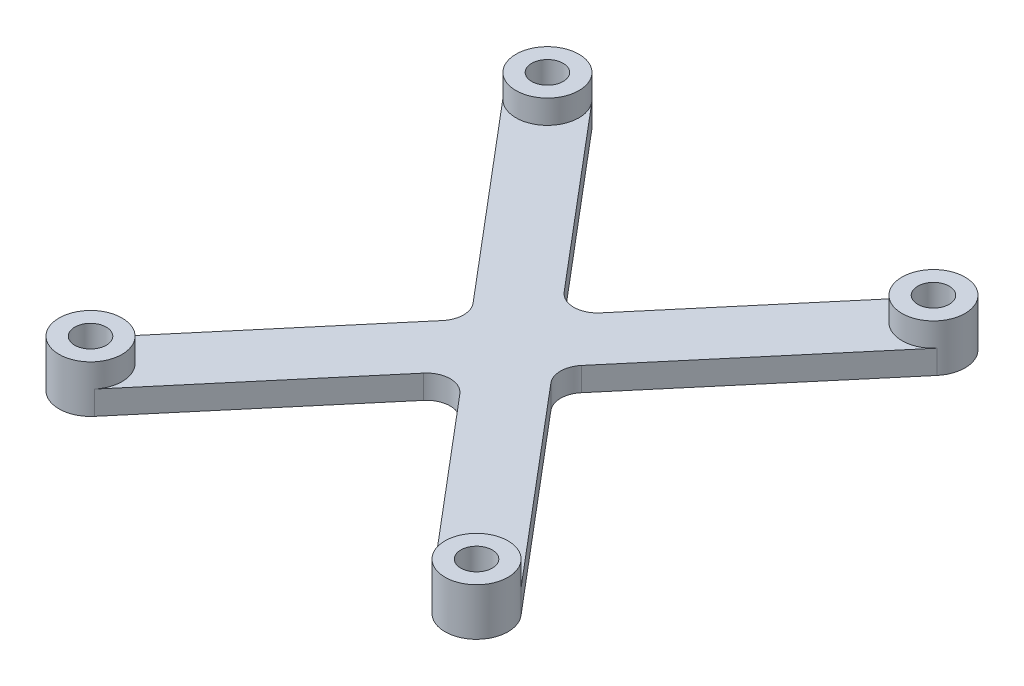
ISO-10303-21;
HEADER;
FILE_DESCRIPTION(('STEP AP214'),'2;1');
FILE_NAME('part.step','',(''),(''),'','','');
FILE_SCHEMA(('AUTOMOTIVE_DESIGN { 1 0 10303 214 1 1 1 1 }'));
ENDSEC;
DATA;
#1=APPLICATION_CONTEXT('core data for automotive mechanical design processes');
#2=APPLICATION_PROTOCOL_DEFINITION('international standard','automotive_design',2000,#1);
#3=PRODUCT_CONTEXT('',#1,'mechanical');
#4=PRODUCT('Part','Part','',(#3));
#5=PRODUCT_RELATED_PRODUCT_CATEGORY('part','',(#4));
#6=PRODUCT_DEFINITION_FORMATION('','',#4);
#7=PRODUCT_DEFINITION_CONTEXT('part definition',#1,'design');
#8=PRODUCT_DEFINITION('design','',#6,#7);
#9=PRODUCT_DEFINITION_SHAPE('','',#8);
#10=(LENGTH_UNIT() NAMED_UNIT(*) SI_UNIT(.MILLI.,.METRE.));
#11=(NAMED_UNIT(*) PLANE_ANGLE_UNIT() SI_UNIT($,.RADIAN.));
#12=(NAMED_UNIT(*) SI_UNIT($,.STERADIAN.) SOLID_ANGLE_UNIT());
#13=UNCERTAINTY_MEASURE_WITH_UNIT(LENGTH_MEASURE(1.E-05),#10,'distance_accuracy_value','');
#14=(GEOMETRIC_REPRESENTATION_CONTEXT(3) GLOBAL_UNCERTAINTY_ASSIGNED_CONTEXT((#13)) GLOBAL_UNIT_ASSIGNED_CONTEXT((#10,
#11,#12)) REPRESENTATION_CONTEXT('',''));
#15=CARTESIAN_POINT('',(0.,0.,0.));
#16=DIRECTION('',(0.,0.,1.));
#17=DIRECTION('',(1.,0.,0.));
#18=AXIS2_PLACEMENT_3D('',#15,#16,#17);
#19=CARTESIAN_POINT('',(0.,3.,0.));
#20=DIRECTION('',(0.,1.,0.));
#21=DIRECTION('',(0.,0.,1.));
#22=AXIS2_PLACEMENT_3D('',#19,#20,#21);
#23=PLANE('',#22);
#24=DIRECTION('',(0.64535164916821,0.,0.763885625546045));
#25=VECTOR('',#24,1.);
#26=CARTESIAN_POINT('',(-3.05554250218419,3.,2.58140659667285));
#27=LINE('',#26,#25);
#28=CARTESIAN_POINT('',(2.29165687663813,3.,8.9107446369115));
#29=VERTEX_POINT('',#28);
#30=CARTESIAN_POINT('',(21.4444574978158,3.,31.5814065966729));
#31=VERTEX_POINT('',#30);
#32=EDGE_CURVE('E168',#29,#31,#27,.T.);
#33=ORIENTED_EDGE('',*,*,#32,.T.);
#34=CARTESIAN_POINT('',(24.5,3.,29.));
#35=DIRECTION('',(0.,1.,0.));
#36=DIRECTION('',(0.,0.,1.));
#37=AXIS2_PLACEMENT_3D('',#34,#35,#36);
#38=CIRCLE('',#37,4.00000000000001);
#39=CARTESIAN_POINT('',(27.5555425021842,3.,26.4185934033272));
#40=VERTEX_POINT('',#39);
#41=EDGE_CURVE('E157',#40,#31,#38,.T.);
#42=ORIENTED_EDGE('',*,*,#41,.F.);
#43=DIRECTION('',(0.64535164916821,0.,0.763885625546045));
#44=VECTOR('',#43,1.);
#45=CARTESIAN_POINT('',(3.05554250218418,3.,-2.58140659667284));
#46=LINE('',#45,#44);
#47=CARTESIAN_POINT('',(6.8720186343341,3.,1.93605494750463));
#48=VERTEX_POINT('',#47);
#49=EDGE_CURVE('E163',#48,#40,#46,.T.);
#50=ORIENTED_EDGE('',*,*,#49,.F.);
#51=CARTESIAN_POINT('',(9.16367551097223,3.,0.));
#52=DIRECTION('',(0.,1.,0.));
#53=DIRECTION('',(0.,0.,1.));
#54=AXIS2_PLACEMENT_3D('',#51,#52,#53);
#55=CIRCLE('',#54,3.);
#56=CARTESIAN_POINT('',(6.8720186343341,3.,-1.93605494750463));
#57=VERTEX_POINT('',#56);
#58=EDGE_CURVE('E196',#48,#57,#55,.F.);
#59=ORIENTED_EDGE('',*,*,#58,.T.);
#60=DIRECTION('',(0.64535164916821,0.,-0.763885625546045));
#61=VECTOR('',#60,1.);
#62=CARTESIAN_POINT('',(3.05554250218418,3.,2.58140659667284));
#63=LINE('',#62,#61);
#64=CARTESIAN_POINT('',(27.5555425021842,3.,-26.4185934033272));
#65=VERTEX_POINT('',#64);
#66=EDGE_CURVE('E167',#57,#65,#63,.T.);
#67=ORIENTED_EDGE('',*,*,#66,.T.);
#68=CARTESIAN_POINT('',(24.5,3.,-29.));
#69=DIRECTION('',(0.,1.,0.));
#70=DIRECTION('',(0.,0.,1.));
#71=AXIS2_PLACEMENT_3D('',#68,#69,#70);
#72=CIRCLE('',#71,4.);
#73=CARTESIAN_POINT('',(21.4444574978158,3.,-31.5814065966729));
#74=VERTEX_POINT('',#73);
#75=EDGE_CURVE('E11',#65,#74,#72,.F.);
#76=ORIENTED_EDGE('',*,*,#75,.T.);
#77=DIRECTION('',(0.64535164916821,0.,-0.763885625546045));
#78=VECTOR('',#77,1.);
#79=CARTESIAN_POINT('',(-3.05554250218418,3.,-2.58140659667284));
#80=LINE('',#79,#78);
#81=CARTESIAN_POINT('',(2.29165687663813,3.,-8.9107446369115));
#82=VERTEX_POINT('',#81);
#83=EDGE_CURVE('E213',#82,#74,#80,.T.);
#84=ORIENTED_EDGE('',*,*,#83,.F.);
#85=CARTESIAN_POINT('',(0.,3.,-10.8467995844161));
#86=DIRECTION('',(0.,1.,0.));
#87=DIRECTION('',(0.,0.,1.));
#88=AXIS2_PLACEMENT_3D('',#85,#86,#87);
#89=CIRCLE('',#88,3.);
#90=CARTESIAN_POINT('',(-2.29165687663814,3.,-8.9107446369115));
#91=VERTEX_POINT('',#90);
#92=EDGE_CURVE('E279',#82,#91,#89,.F.);
#93=ORIENTED_EDGE('',*,*,#92,.T.);
#94=DIRECTION('',(0.64535164916821,0.,0.763885625546045));
#95=VECTOR('',#94,1.);
#96=CARTESIAN_POINT('',(3.05554250218418,3.,-2.58140659667284));
#97=LINE('',#96,#95);
#98=CARTESIAN_POINT('',(-21.4444574978158,3.,-31.5814065966728));
#99=VERTEX_POINT('',#98);
#100=EDGE_CURVE('E197',#99,#91,#97,.T.);
#101=ORIENTED_EDGE('',*,*,#100,.F.);
#102=CARTESIAN_POINT('',(-24.5,3.,-29.));
#103=DIRECTION('',(0.,1.,0.));
#104=DIRECTION('',(0.,0.,1.));
#105=AXIS2_PLACEMENT_3D('',#102,#103,#104);
#106=CIRCLE('',#105,4.);
#107=CARTESIAN_POINT('',(-27.5555425021842,3.,-26.4185934033272));
#108=VERTEX_POINT('',#107);
#109=EDGE_CURVE('E46',#108,#99,#106,.T.);
#110=ORIENTED_EDGE('',*,*,#109,.F.);
#111=DIRECTION('',(0.64535164916821,0.,0.763885625546045));
#112=VECTOR('',#111,1.);
#113=CARTESIAN_POINT('',(-3.05554250218419,3.,2.58140659667285));
#114=LINE('',#113,#112);
#115=CARTESIAN_POINT('',(-6.87201863433412,3.,-1.93605494750463));
#116=VERTEX_POINT('',#115);
#117=EDGE_CURVE('E200',#108,#116,#114,.T.);
#118=ORIENTED_EDGE('',*,*,#117,.T.);
#119=CARTESIAN_POINT('',(-9.16367551097225,3.,0.));
#120=DIRECTION('',(0.,1.,0.));
#121=DIRECTION('',(0.,0.,1.));
#122=AXIS2_PLACEMENT_3D('',#119,#120,#121);
#123=CIRCLE('',#122,3.);
#124=CARTESIAN_POINT('',(-6.87201863433412,3.,1.93605494750463));
#125=VERTEX_POINT('',#124);
#126=EDGE_CURVE('E283',#116,#125,#123,.F.);
#127=ORIENTED_EDGE('',*,*,#126,.T.);
#128=DIRECTION('',(0.64535164916821,0.,-0.763885625546045));
#129=VECTOR('',#128,1.);
#130=CARTESIAN_POINT('',(-3.05554250218418,3.,-2.58140659667284));
#131=LINE('',#130,#129);
#132=CARTESIAN_POINT('',(-27.5555425021842,3.,26.4185934033272));
#133=VERTEX_POINT('',#132);
#134=EDGE_CURVE('E204',#133,#125,#131,.T.);
#135=ORIENTED_EDGE('',*,*,#134,.F.);
#136=CARTESIAN_POINT('',(-24.5,3.,29.));
#137=DIRECTION('',(0.,1.,0.));
#138=DIRECTION('',(0.,0.,1.));
#139=AXIS2_PLACEMENT_3D('',#136,#137,#138);
#140=CIRCLE('',#139,4.);
#141=CARTESIAN_POINT('',(-21.4444574978158,3.,31.5814065966728));
#142=VERTEX_POINT('',#141);
#143=EDGE_CURVE('E176',#142,#133,#140,.T.);
#144=ORIENTED_EDGE('',*,*,#143,.F.);
#145=DIRECTION('',(0.64535164916821,0.,-0.763885625546045));
#146=VECTOR('',#145,1.);
#147=CARTESIAN_POINT('',(3.05554250218418,3.,2.58140659667284));
#148=LINE('',#147,#146);
#149=CARTESIAN_POINT('',(-2.29165687663814,3.,8.9107446369115));
#150=VERTEX_POINT('',#149);
#151=EDGE_CURVE('E207',#142,#150,#148,.T.);
#152=ORIENTED_EDGE('',*,*,#151,.T.);
#153=CARTESIAN_POINT('',(0.,3.,10.8467995844161));
#154=DIRECTION('',(0.,1.,0.));
#155=DIRECTION('',(0.,0.,1.));
#156=AXIS2_PLACEMENT_3D('',#153,#154,#155);
#157=CIRCLE('',#156,3.);
#158=EDGE_CURVE('E287',#150,#29,#157,.F.);
#159=ORIENTED_EDGE('',*,*,#158,.T.);
#160=EDGE_LOOP('',(#33,#42,#50,#59,#67,#76,#84,#93,#101,#110,#118,#127,#135,#144,#152,#159));
#161=FACE_BOUND('',#160,.T.);
#162=ADVANCED_FACE('F38',(#161),#23,.T.);
#163=CARTESIAN_POINT('',(3.05554250218418,3.,-2.58140659667284));
#164=DIRECTION('',(0.763885625546045,0.,-0.64535164916821));
#165=DIRECTION('',(-0.64535164916821,0.,-0.763885625546045));
#166=AXIS2_PLACEMENT_3D('',#163,#164,#165);
#167=PLANE('',#166);
#168=ORIENTED_EDGE('',*,*,#100,.T.);
#169=DIRECTION('',(0.,-1.,0.));
#170=VECTOR('',#169,1.);
#171=CARTESIAN_POINT('',(-2.29165687663814,0.,-8.9107446369115));
#172=LINE('',#171,#170);
#173=CARTESIAN_POINT('',(-2.29165687663814,0.,-8.9107446369115));
#174=VERTEX_POINT('',#173);
#175=EDGE_CURVE('E258',#91,#174,#172,.T.);
#176=ORIENTED_EDGE('',*,*,#175,.T.);
#177=DIRECTION('',(0.64535164916821,0.,0.763885625546045));
#178=VECTOR('',#177,1.);
#179=CARTESIAN_POINT('',(3.05554250218418,0.,-2.58140659667284));
#180=LINE('',#179,#178);
#181=CARTESIAN_POINT('',(-21.4444574978158,0.,-31.5814065966728));
#182=VERTEX_POINT('',#181);
#183=EDGE_CURVE('E193',#182,#174,#180,.T.);
#184=ORIENTED_EDGE('',*,*,#183,.F.);
#185=DIRECTION('',(0.,-1.,0.));
#186=VECTOR('',#185,1.);
#187=CARTESIAN_POINT('',(-21.4444574978158,3.,-31.5814065966728));
#188=LINE('',#187,#186);
#189=EDGE_CURVE('E256',#99,#182,#188,.T.);
#190=ORIENTED_EDGE('',*,*,#189,.F.);
#191=EDGE_LOOP('',(#168,#176,#184,#190));
#192=FACE_BOUND('',#191,.T.);
#193=ADVANCED_FACE('F308',(#192),#167,.T.);
#194=CARTESIAN_POINT('',(-24.5,3.,-29.));
#195=DIRECTION('',(0.,-1.,0.));
#196=DIRECTION('',(0.,0.,-1.));
#197=AXIS2_PLACEMENT_3D('',#194,#195,#196);
#198=CYLINDRICAL_SURFACE('',#197,4.);
#199=CARTESIAN_POINT('',(-24.5,0.,-29.));
#200=DIRECTION('',(0.,1.,0.));
#201=DIRECTION('',(0.,0.,1.));
#202=AXIS2_PLACEMENT_3D('',#199,#200,#201);
#203=CIRCLE('',#202,4.);
#204=CARTESIAN_POINT('',(-27.5555425021842,0.,-26.4185934033272));
#205=VERTEX_POINT('',#204);
#206=EDGE_CURVE('E219',#182,#205,#203,.T.);
#207=ORIENTED_EDGE('',*,*,#206,.T.);
#208=DIRECTION('',(0.,-1.,0.));
#209=VECTOR('',#208,1.);
#210=CARTESIAN_POINT('',(-27.5555425021842,3.,-26.4185934033272));
#211=LINE('',#210,#209);
#212=EDGE_CURVE('E253',#108,#205,#211,.T.);
#213=ORIENTED_EDGE('',*,*,#212,.F.);
#214=ORIENTED_EDGE('',*,*,#109,.T.);
#215=ORIENTED_EDGE('',*,*,#189,.T.);
#216=EDGE_LOOP('',(#207,#213,#214,#215));
#217=FACE_BOUND('',#216,.T.);
#218=CARTESIAN_POINT('',(-24.5,6.,-29.));
#219=DIRECTION('',(0.,1.,0.));
#220=DIRECTION('',(0.,0.,1.));
#221=AXIS2_PLACEMENT_3D('',#218,#219,#220);
#222=CIRCLE('',#221,4.);
#223=CARTESIAN_POINT('',(-24.5,6.,-25.));
#224=VERTEX_POINT('',#223);
#225=EDGE_CURVE('E190',#224,#224,#222,.T.);
#226=ORIENTED_EDGE('',*,*,#225,.F.);
#227=EDGE_LOOP('',(#226));
#228=FACE_BOUND('',#227,.T.);
#229=ADVANCED_FACE('F313',(#217,#228),#198,.T.);
#230=CARTESIAN_POINT('',(-3.05554250218419,3.,2.58140659667285));
#231=DIRECTION('',(0.763885625546045,0.,-0.64535164916821));
#232=DIRECTION('',(-0.64535164916821,0.,-0.763885625546045));
#233=AXIS2_PLACEMENT_3D('',#230,#231,#232);
#234=PLANE('',#233);
#235=DIRECTION('',(0.64535164916821,0.,0.763885625546045));
#236=VECTOR('',#235,1.);
#237=CARTESIAN_POINT('',(-3.05554250218419,0.,2.58140659667285));
#238=LINE('',#237,#236);
#239=CARTESIAN_POINT('',(-6.87201863433412,0.,-1.93605494750463));
#240=VERTEX_POINT('',#239);
#241=EDGE_CURVE('E221',#205,#240,#238,.T.);
#242=ORIENTED_EDGE('',*,*,#241,.T.);
#243=DIRECTION('',(0.,-1.,0.));
#244=VECTOR('',#243,1.);
#245=CARTESIAN_POINT('',(-6.87201863433412,3.,-1.93605494750463));
#246=LINE('',#245,#244);
#247=EDGE_CURVE('E266',#240,#116,#246,.F.);
#248=ORIENTED_EDGE('',*,*,#247,.T.);
#249=ORIENTED_EDGE('',*,*,#117,.F.);
#250=ORIENTED_EDGE('',*,*,#212,.T.);
#251=EDGE_LOOP('',(#242,#248,#249,#250));
#252=FACE_BOUND('',#251,.T.);
#253=ADVANCED_FACE('F352',(#252),#234,.F.);
#254=CARTESIAN_POINT('',(-3.05554250218418,3.,-2.58140659667284));
#255=DIRECTION('',(-0.763885625546044,0.,-0.64535164916821));
#256=DIRECTION('',(-0.64535164916821,0.,0.763885625546045));
#257=AXIS2_PLACEMENT_3D('',#254,#255,#256);
#258=PLANE('',#257);
#259=ORIENTED_EDGE('',*,*,#134,.T.);
#260=DIRECTION('',(0.,-1.,0.));
#261=VECTOR('',#260,1.);
#262=CARTESIAN_POINT('',(-6.87201863433412,3.,1.93605494750463));
#263=LINE('',#262,#261);
#264=CARTESIAN_POINT('',(-6.87201863433412,0.,1.93605494750463));
#265=VERTEX_POINT('',#264);
#266=EDGE_CURVE('E263',#125,#265,#263,.T.);
#267=ORIENTED_EDGE('',*,*,#266,.T.);
#268=DIRECTION('',(0.64535164916821,0.,-0.763885625546045));
#269=VECTOR('',#268,1.);
#270=CARTESIAN_POINT('',(-3.05554250218418,0.,-2.58140659667284));
#271=LINE('',#270,#269);
#272=CARTESIAN_POINT('',(-27.5555425021842,0.,26.4185934033272));
#273=VERTEX_POINT('',#272);
#274=EDGE_CURVE('E224',#273,#265,#271,.T.);
#275=ORIENTED_EDGE('',*,*,#274,.F.);
#276=DIRECTION('',(0.,-1.,0.));
#277=VECTOR('',#276,1.);
#278=CARTESIAN_POINT('',(-27.5555425021842,3.,26.4185934033272));
#279=LINE('',#278,#277);
#280=EDGE_CURVE('E251',#133,#273,#279,.T.);
#281=ORIENTED_EDGE('',*,*,#280,.F.);
#282=EDGE_LOOP('',(#259,#267,#275,#281));
#283=FACE_BOUND('',#282,.T.);
#284=ADVANCED_FACE('F348',(#283),#258,.T.);
#285=CARTESIAN_POINT('',(-24.5,3.,29.));
#286=DIRECTION('',(0.,-1.,0.));
#287=DIRECTION('',(0.,0.,-1.));
#288=AXIS2_PLACEMENT_3D('',#285,#286,#287);
#289=CYLINDRICAL_SURFACE('',#288,4.);
#290=CARTESIAN_POINT('',(-24.5,0.,29.));
#291=DIRECTION('',(0.,1.,0.));
#292=DIRECTION('',(0.,0.,1.));
#293=AXIS2_PLACEMENT_3D('',#290,#291,#292);
#294=CIRCLE('',#293,4.);
#295=CARTESIAN_POINT('',(-21.4444574978158,0.,31.5814065966728));
#296=VERTEX_POINT('',#295);
#297=EDGE_CURVE('E227',#273,#296,#294,.T.);
#298=ORIENTED_EDGE('',*,*,#297,.T.);
#299=DIRECTION('',(0.,-1.,0.));
#300=VECTOR('',#299,1.);
#301=CARTESIAN_POINT('',(-21.4444574978158,3.,31.5814065966728));
#302=LINE('',#301,#300);
#303=EDGE_CURVE('E248',#142,#296,#302,.T.);
#304=ORIENTED_EDGE('',*,*,#303,.F.);
#305=ORIENTED_EDGE('',*,*,#143,.T.);
#306=ORIENTED_EDGE('',*,*,#280,.T.);
#307=EDGE_LOOP('',(#298,#304,#305,#306));
#308=FACE_BOUND('',#307,.T.);
#309=CARTESIAN_POINT('',(-24.5,6.,29.));
#310=DIRECTION('',(0.,1.,0.));
#311=DIRECTION('',(0.,0.,1.));
#312=AXIS2_PLACEMENT_3D('',#309,#310,#311);
#313=CIRCLE('',#312,4.);
#314=CARTESIAN_POINT('',(-24.5,6.,33.));
#315=VERTEX_POINT('',#314);
#316=EDGE_CURVE('E172',#315,#315,#313,.T.);
#317=ORIENTED_EDGE('',*,*,#316,.F.);
#318=EDGE_LOOP('',(#317));
#319=FACE_BOUND('',#318,.T.);
#320=ADVANCED_FACE('F344',(#308,#319),#289,.T.);
#321=CARTESIAN_POINT('',(3.05554250218418,3.,2.58140659667284));
#322=DIRECTION('',(-0.763885625546044,0.,-0.64535164916821));
#323=DIRECTION('',(-0.64535164916821,0.,0.763885625546045));
#324=AXIS2_PLACEMENT_3D('',#321,#322,#323);
#325=PLANE('',#324);
#326=DIRECTION('',(0.64535164916821,0.,-0.763885625546045));
#327=VECTOR('',#326,1.);
#328=CARTESIAN_POINT('',(3.05554250218418,0.,2.58140659667284));
#329=LINE('',#328,#327);
#330=CARTESIAN_POINT('',(-2.29165687663814,0.,8.9107446369115));
#331=VERTEX_POINT('',#330);
#332=EDGE_CURVE('E229',#296,#331,#329,.T.);
#333=ORIENTED_EDGE('',*,*,#332,.T.);
#334=DIRECTION('',(0.,-1.,0.));
#335=VECTOR('',#334,1.);
#336=CARTESIAN_POINT('',(-2.29165687663814,3.,8.9107446369115));
#337=LINE('',#336,#335);
#338=EDGE_CURVE('E271',#331,#150,#337,.F.);
#339=ORIENTED_EDGE('',*,*,#338,.T.);
#340=ORIENTED_EDGE('',*,*,#151,.F.);
#341=ORIENTED_EDGE('',*,*,#303,.T.);
#342=EDGE_LOOP('',(#333,#339,#340,#341));
#343=FACE_BOUND('',#342,.T.);
#344=ADVANCED_FACE('F340',(#343),#325,.F.);
#345=CARTESIAN_POINT('',(-3.05554250218419,3.,2.58140659667285));
#346=DIRECTION('',(0.763885625546045,0.,-0.64535164916821));
#347=DIRECTION('',(-0.64535164916821,0.,-0.763885625546045));
#348=AXIS2_PLACEMENT_3D('',#345,#346,#347);
#349=PLANE('',#348);
#350=ORIENTED_EDGE('',*,*,#32,.F.);
#351=DIRECTION('',(0.,-1.,0.));
#352=VECTOR('',#351,1.);
#353=CARTESIAN_POINT('',(2.29165687663812,0.,8.9107446369115));
#354=LINE('',#353,#352);
#355=CARTESIAN_POINT('',(2.29165687663813,0.,8.9107446369115));
#356=VERTEX_POINT('',#355);
#357=EDGE_CURVE('E268',#29,#356,#354,.T.);
#358=ORIENTED_EDGE('',*,*,#357,.T.);
#359=DIRECTION('',(0.64535164916821,0.,0.763885625546045));
#360=VECTOR('',#359,1.);
#361=CARTESIAN_POINT('',(-3.05554250218419,0.,2.58140659667285));
#362=LINE('',#361,#360);
#363=CARTESIAN_POINT('',(21.4444574978158,0.,31.5814065966729));
#364=VERTEX_POINT('',#363);
#365=EDGE_CURVE('E232',#356,#364,#362,.T.);
#366=ORIENTED_EDGE('',*,*,#365,.T.);
#367=DIRECTION('',(0.,-1.,0.));
#368=VECTOR('',#367,1.);
#369=CARTESIAN_POINT('',(21.4444574978158,3.,31.5814065966729));
#370=LINE('',#369,#368);
#371=EDGE_CURVE('E160',#31,#364,#370,.T.);
#372=ORIENTED_EDGE('',*,*,#371,.F.);
#373=EDGE_LOOP('',(#350,#358,#366,#372));
#374=FACE_BOUND('',#373,.T.);
#375=ADVANCED_FACE('F337',(#374),#349,.F.);
#376=CARTESIAN_POINT('',(24.5,3.,29.));
#377=DIRECTION('',(0.,-1.,0.));
#378=DIRECTION('',(0.,0.,-1.));
#379=AXIS2_PLACEMENT_3D('',#376,#377,#378);
#380=CYLINDRICAL_SURFACE('',#379,4.00000000000001);
#381=CARTESIAN_POINT('',(24.5,0.,29.));
#382=DIRECTION('',(0.,1.,0.));
#383=DIRECTION('',(0.,0.,1.));
#384=AXIS2_PLACEMENT_3D('',#381,#382,#383);
#385=CIRCLE('',#384,4.00000000000001);
#386=CARTESIAN_POINT('',(27.5555425021842,0.,26.4185934033272));
#387=VERTEX_POINT('',#386);
#388=EDGE_CURVE('E159',#364,#387,#385,.T.);
#389=ORIENTED_EDGE('',*,*,#388,.T.);
#390=DIRECTION('',(0.,-1.,0.));
#391=VECTOR('',#390,1.);
#392=CARTESIAN_POINT('',(27.5555425021842,3.,26.4185934033272));
#393=LINE('',#392,#391);
#394=EDGE_CURVE('E152',#40,#387,#393,.T.);
#395=ORIENTED_EDGE('',*,*,#394,.F.);
#396=ORIENTED_EDGE('',*,*,#41,.T.);
#397=ORIENTED_EDGE('',*,*,#371,.T.);
#398=EDGE_LOOP('',(#389,#395,#396,#397));
#399=FACE_BOUND('',#398,.T.);
#400=CARTESIAN_POINT('',(24.5,6.,29.));
#401=DIRECTION('',(0.,1.,0.));
#402=DIRECTION('',(0.,0.,1.));
#403=AXIS2_PLACEMENT_3D('',#400,#401,#402);
#404=CIRCLE('',#403,4.00000000000001);
#405=CARTESIAN_POINT('',(24.5,6.,33.));
#406=VERTEX_POINT('',#405);
#407=EDGE_CURVE('E173',#406,#406,#404,.T.);
#408=ORIENTED_EDGE('',*,*,#407,.F.);
#409=EDGE_LOOP('',(#408));
#410=FACE_BOUND('',#409,.T.);
#411=ADVANCED_FACE('F153',(#399,#410),#380,.T.);
#412=CARTESIAN_POINT('',(3.05554250218418,3.,-2.58140659667284));
#413=DIRECTION('',(0.763885625546045,0.,-0.64535164916821));
#414=DIRECTION('',(-0.64535164916821,0.,-0.763885625546045));
#415=AXIS2_PLACEMENT_3D('',#412,#413,#414);
#416=PLANE('',#415);
#417=DIRECTION('',(0.64535164916821,0.,0.763885625546045));
#418=VECTOR('',#417,1.);
#419=CARTESIAN_POINT('',(3.05554250218418,0.,-2.58140659667284));
#420=LINE('',#419,#418);
#421=CARTESIAN_POINT('',(6.8720186343341,0.,1.93605494750463));
#422=VERTEX_POINT('',#421);
#423=EDGE_CURVE('E235',#422,#387,#420,.T.);
#424=ORIENTED_EDGE('',*,*,#423,.F.);
#425=DIRECTION('',(0.,-1.,0.));
#426=VECTOR('',#425,1.);
#427=CARTESIAN_POINT('',(6.8720186343341,3.,1.93605494750463));
#428=LINE('',#427,#426);
#429=EDGE_CURVE('E53',#422,#48,#428,.F.);
#430=ORIENTED_EDGE('',*,*,#429,.T.);
#431=ORIENTED_EDGE('',*,*,#49,.T.);
#432=ORIENTED_EDGE('',*,*,#394,.T.);
#433=EDGE_LOOP('',(#424,#430,#431,#432));
#434=FACE_BOUND('',#433,.T.);
#435=ADVANCED_FACE('F164',(#434),#416,.T.);
#436=CARTESIAN_POINT('',(3.05554250218418,3.,2.58140659667284));
#437=DIRECTION('',(-0.763885625546044,0.,-0.64535164916821));
#438=DIRECTION('',(-0.64535164916821,0.,0.763885625546045));
#439=AXIS2_PLACEMENT_3D('',#436,#437,#438);
#440=PLANE('',#439);
#441=ORIENTED_EDGE('',*,*,#66,.F.);
#442=DIRECTION('',(0.,-1.,0.));
#443=VECTOR('',#442,1.);
#444=CARTESIAN_POINT('',(6.8720186343341,3.,-1.93605494750463));
#445=LINE('',#444,#443);
#446=CARTESIAN_POINT('',(6.8720186343341,0.,-1.93605494750463));
#447=VERTEX_POINT('',#446);
#448=EDGE_CURVE('E273',#57,#447,#445,.T.);
#449=ORIENTED_EDGE('',*,*,#448,.T.);
#450=DIRECTION('',(0.64535164916821,0.,-0.763885625546045));
#451=VECTOR('',#450,1.);
#452=CARTESIAN_POINT('',(3.05554250218418,0.,2.58140659667284));
#453=LINE('',#452,#451);
#454=CARTESIAN_POINT('',(27.5555425021842,0.,-26.4185934033272));
#455=VERTEX_POINT('',#454);
#456=EDGE_CURVE('E237',#447,#455,#453,.T.);
#457=ORIENTED_EDGE('',*,*,#456,.T.);
#458=DIRECTION('',(0.,-1.,0.));
#459=VECTOR('',#458,1.);
#460=CARTESIAN_POINT('',(27.5555425021842,3.,-26.4185934033272));
#461=LINE('',#460,#459);
#462=EDGE_CURVE('E161',#65,#455,#461,.T.);
#463=ORIENTED_EDGE('',*,*,#462,.F.);
#464=EDGE_LOOP('',(#441,#449,#457,#463));
#465=FACE_BOUND('',#464,.T.);
#466=ADVANCED_FACE('F294',(#465),#440,.F.);
#467=CARTESIAN_POINT('',(24.5,3.,-29.));
#468=DIRECTION('',(0.,-1.,0.));
#469=DIRECTION('',(0.,0.,-1.));
#470=AXIS2_PLACEMENT_3D('',#467,#468,#469);
#471=CYLINDRICAL_SURFACE('',#470,4.);
#472=CARTESIAN_POINT('',(24.5,0.,-29.));
#473=DIRECTION('',(0.,1.,0.));
#474=DIRECTION('',(0.,0.,1.));
#475=AXIS2_PLACEMENT_3D('',#472,#473,#474);
#476=CIRCLE('',#475,4.);
#477=CARTESIAN_POINT('',(21.4444574978158,0.,-31.5814065966729));
#478=VERTEX_POINT('',#477);
#479=EDGE_CURVE('E239',#455,#478,#476,.T.);
#480=ORIENTED_EDGE('',*,*,#479,.T.);
#481=DIRECTION('',(0.,-1.,0.));
#482=VECTOR('',#481,1.);
#483=CARTESIAN_POINT('',(21.4444574978158,3.,-31.5814065966729));
#484=LINE('',#483,#482);
#485=EDGE_CURVE('E216',#74,#478,#484,.T.);
#486=ORIENTED_EDGE('',*,*,#485,.F.);
#487=ORIENTED_EDGE('',*,*,#75,.F.);
#488=ORIENTED_EDGE('',*,*,#462,.T.);
#489=EDGE_LOOP('',(#480,#486,#487,#488));
#490=FACE_BOUND('',#489,.T.);
#491=CARTESIAN_POINT('',(24.5,6.,-29.));
#492=DIRECTION('',(0.,1.,0.));
#493=DIRECTION('',(0.,0.,1.));
#494=AXIS2_PLACEMENT_3D('',#491,#492,#493);
#495=CIRCLE('',#494,4.);
#496=CARTESIAN_POINT('',(24.5,6.,-25.));
#497=VERTEX_POINT('',#496);
#498=EDGE_CURVE('E186',#497,#497,#495,.T.);
#499=ORIENTED_EDGE('',*,*,#498,.F.);
#500=EDGE_LOOP('',(#499));
#501=FACE_BOUND('',#500,.T.);
#502=ADVANCED_FACE('F326',(#490,#501),#471,.T.);
#503=CARTESIAN_POINT('',(-3.05554250218418,3.,-2.58140659667284));
#504=DIRECTION('',(-0.763885625546044,0.,-0.64535164916821));
#505=DIRECTION('',(-0.64535164916821,0.,0.763885625546045));
#506=AXIS2_PLACEMENT_3D('',#503,#504,#505);
#507=PLANE('',#506);
#508=DIRECTION('',(0.64535164916821,0.,-0.763885625546045));
#509=VECTOR('',#508,1.);
#510=CARTESIAN_POINT('',(-3.05554250218418,0.,-2.58140659667284));
#511=LINE('',#510,#509);
#512=CARTESIAN_POINT('',(2.29165687663813,0.,-8.9107446369115));
#513=VERTEX_POINT('',#512);
#514=EDGE_CURVE('E201',#513,#478,#511,.T.);
#515=ORIENTED_EDGE('',*,*,#514,.F.);
#516=DIRECTION('',(0.,-1.,0.));
#517=VECTOR('',#516,1.);
#518=CARTESIAN_POINT('',(2.29165687663813,3.,-8.9107446369115));
#519=LINE('',#518,#517);
#520=EDGE_CURVE('E261',#513,#82,#519,.F.);
#521=ORIENTED_EDGE('',*,*,#520,.T.);
#522=ORIENTED_EDGE('',*,*,#83,.T.);
#523=ORIENTED_EDGE('',*,*,#485,.T.);
#524=EDGE_LOOP('',(#515,#521,#522,#523));
#525=FACE_BOUND('',#524,.T.);
#526=ADVANCED_FACE('F322',(#525),#507,.T.);
#527=CARTESIAN_POINT('',(0.,0.,0.));
#528=DIRECTION('',(0.,1.,0.));
#529=DIRECTION('',(0.,0.,1.));
#530=AXIS2_PLACEMENT_3D('',#527,#528,#529);
#531=PLANE('',#530);
#532=CARTESIAN_POINT('',(24.5,0.,29.));
#533=DIRECTION('',(0.,1.,0.));
#534=DIRECTION('',(0.,0.,1.));
#535=AXIS2_PLACEMENT_3D('',#532,#533,#534);
#536=CIRCLE('',#535,2.);
#537=CARTESIAN_POINT('',(24.5,0.,31.));
#538=VERTEX_POINT('',#537);
#539=EDGE_CURVE('E449',#538,#538,#536,.T.);
#540=ORIENTED_EDGE('',*,*,#539,.T.);
#541=EDGE_LOOP('',(#540));
#542=FACE_BOUND('',#541,.T.);
#543=CARTESIAN_POINT('',(24.5,0.,-29.));
#544=DIRECTION('',(0.,1.,0.));
#545=DIRECTION('',(0.,0.,1.));
#546=AXIS2_PLACEMENT_3D('',#543,#544,#545);
#547=CIRCLE('',#546,2.);
#548=CARTESIAN_POINT('',(24.5,0.,-27.));
#549=VERTEX_POINT('',#548);
#550=EDGE_CURVE('E443',#549,#549,#547,.T.);
#551=ORIENTED_EDGE('',*,*,#550,.T.);
#552=EDGE_LOOP('',(#551));
#553=FACE_BOUND('',#552,.T.);
#554=CARTESIAN_POINT('',(-24.5,0.,-29.));
#555=DIRECTION('',(0.,1.,0.));
#556=DIRECTION('',(0.,0.,1.));
#557=AXIS2_PLACEMENT_3D('',#554,#555,#556);
#558=CIRCLE('',#557,2.);
#559=CARTESIAN_POINT('',(-24.5,0.,-27.));
#560=VERTEX_POINT('',#559);
#561=EDGE_CURVE('E432',#560,#560,#558,.T.);
#562=ORIENTED_EDGE('',*,*,#561,.T.);
#563=EDGE_LOOP('',(#562));
#564=FACE_BOUND('',#563,.T.);
#565=CARTESIAN_POINT('',(-24.5,0.,29.));
#566=DIRECTION('',(0.,1.,0.));
#567=DIRECTION('',(0.,0.,1.));
#568=AXIS2_PLACEMENT_3D('',#565,#566,#567);
#569=CIRCLE('',#568,2.);
#570=CARTESIAN_POINT('',(-24.5,0.,31.));
#571=VERTEX_POINT('',#570);
#572=EDGE_CURVE('E179',#571,#571,#569,.T.);
#573=ORIENTED_EDGE('',*,*,#572,.T.);
#574=EDGE_LOOP('',(#573));
#575=FACE_BOUND('',#574,.T.);
#576=ORIENTED_EDGE('',*,*,#183,.T.);
#577=CARTESIAN_POINT('',(0.,0.,-10.8467995844161));
#578=DIRECTION('',(0.,1.,0.));
#579=DIRECTION('',(0.,0.,1.));
#580=AXIS2_PLACEMENT_3D('',#577,#578,#579);
#581=CIRCLE('',#580,3.);
#582=EDGE_CURVE('E277',#174,#513,#581,.T.);
#583=ORIENTED_EDGE('',*,*,#582,.T.);
#584=ORIENTED_EDGE('',*,*,#514,.T.);
#585=ORIENTED_EDGE('',*,*,#479,.F.);
#586=ORIENTED_EDGE('',*,*,#456,.F.);
#587=CARTESIAN_POINT('',(9.16367551097223,0.,0.));
#588=DIRECTION('',(0.,1.,0.));
#589=DIRECTION('',(0.,0.,1.));
#590=AXIS2_PLACEMENT_3D('',#587,#588,#589);
#591=CIRCLE('',#590,3.);
#592=EDGE_CURVE('E61',#447,#422,#591,.T.);
#593=ORIENTED_EDGE('',*,*,#592,.T.);
#594=ORIENTED_EDGE('',*,*,#423,.T.);
#595=ORIENTED_EDGE('',*,*,#388,.F.);
#596=ORIENTED_EDGE('',*,*,#365,.F.);
#597=CARTESIAN_POINT('',(0.,0.,10.8467995844161));
#598=DIRECTION('',(0.,1.,0.));
#599=DIRECTION('',(0.,0.,1.));
#600=AXIS2_PLACEMENT_3D('',#597,#598,#599);
#601=CIRCLE('',#600,3.);
#602=EDGE_CURVE('E285',#356,#331,#601,.T.);
#603=ORIENTED_EDGE('',*,*,#602,.T.);
#604=ORIENTED_EDGE('',*,*,#332,.F.);
#605=ORIENTED_EDGE('',*,*,#297,.F.);
#606=ORIENTED_EDGE('',*,*,#274,.T.);
#607=CARTESIAN_POINT('',(-9.16367551097225,0.,0.));
#608=DIRECTION('',(0.,1.,0.));
#609=DIRECTION('',(0.,0.,1.));
#610=AXIS2_PLACEMENT_3D('',#607,#608,#609);
#611=CIRCLE('',#610,3.);
#612=EDGE_CURVE('E281',#265,#240,#611,.T.);
#613=ORIENTED_EDGE('',*,*,#612,.T.);
#614=ORIENTED_EDGE('',*,*,#241,.F.);
#615=ORIENTED_EDGE('',*,*,#206,.F.);
#616=EDGE_LOOP('',(#576,#583,#584,#585,#586,#593,#594,#595,#596,#603,#604,#605,#606,#613,#614,#615));
#617=FACE_BOUND('',#616,.T.);
#618=ADVANCED_FACE('F318',(#542,#553,#564,#575,#617),#531,.F.);
#619=CARTESIAN_POINT('',(0.,3.,-10.8467995844161));
#620=DIRECTION('',(0.,1.,0.));
#621=DIRECTION('',(0.,0.,1.));
#622=AXIS2_PLACEMENT_3D('',#619,#620,#621);
#623=CYLINDRICAL_SURFACE('',#622,3.);
#624=ORIENTED_EDGE('',*,*,#92,.F.);
#625=ORIENTED_EDGE('',*,*,#520,.F.);
#626=ORIENTED_EDGE('',*,*,#582,.F.);
#627=ORIENTED_EDGE('',*,*,#175,.F.);
#628=EDGE_LOOP('',(#624,#625,#626,#627));
#629=FACE_BOUND('',#628,.T.);
#630=ADVANCED_FACE('F321',(#629),#623,.F.);
#631=CARTESIAN_POINT('',(-9.16367551097225,3.,0.));
#632=DIRECTION('',(0.,-1.,0.));
#633=DIRECTION('',(0.,0.,-1.));
#634=AXIS2_PLACEMENT_3D('',#631,#632,#633);
#635=CYLINDRICAL_SURFACE('',#634,3.);
#636=ORIENTED_EDGE('',*,*,#126,.F.);
#637=ORIENTED_EDGE('',*,*,#247,.F.);
#638=ORIENTED_EDGE('',*,*,#612,.F.);
#639=ORIENTED_EDGE('',*,*,#266,.F.);
#640=EDGE_LOOP('',(#636,#637,#638,#639));
#641=FACE_BOUND('',#640,.T.);
#642=ADVANCED_FACE('F305',(#641),#635,.F.);
#643=CARTESIAN_POINT('',(0.,3.,10.8467995844161));
#644=DIRECTION('',(0.,1.,0.));
#645=DIRECTION('',(0.,0.,1.));
#646=AXIS2_PLACEMENT_3D('',#643,#644,#645);
#647=CYLINDRICAL_SURFACE('',#646,3.);
#648=ORIENTED_EDGE('',*,*,#158,.F.);
#649=ORIENTED_EDGE('',*,*,#338,.F.);
#650=ORIENTED_EDGE('',*,*,#602,.F.);
#651=ORIENTED_EDGE('',*,*,#357,.F.);
#652=EDGE_LOOP('',(#648,#649,#650,#651));
#653=FACE_BOUND('',#652,.T.);
#654=ADVANCED_FACE('F297',(#653),#647,.F.);
#655=CARTESIAN_POINT('',(9.16367551097223,3.,0.));
#656=DIRECTION('',(0.,-1.,0.));
#657=DIRECTION('',(0.,0.,-1.));
#658=AXIS2_PLACEMENT_3D('',#655,#656,#657);
#659=CYLINDRICAL_SURFACE('',#658,3.);
#660=ORIENTED_EDGE('',*,*,#58,.F.);
#661=ORIENTED_EDGE('',*,*,#429,.F.);
#662=ORIENTED_EDGE('',*,*,#592,.F.);
#663=ORIENTED_EDGE('',*,*,#448,.F.);
#664=EDGE_LOOP('',(#660,#661,#662,#663));
#665=FACE_BOUND('',#664,.T.);
#666=ADVANCED_FACE('F40',(#665),#659,.F.);
#667=CARTESIAN_POINT('',(-24.5,6.,-29.));
#668=DIRECTION('',(0.,1.,0.));
#669=DIRECTION('',(0.,0.,1.));
#670=AXIS2_PLACEMENT_3D('',#667,#668,#669);
#671=PLANE('',#670);
#672=CARTESIAN_POINT('',(-24.5,6.,-29.));
#673=DIRECTION('',(0.,1.,0.));
#674=DIRECTION('',(0.,0.,1.));
#675=AXIS2_PLACEMENT_3D('',#672,#673,#674);
#676=CIRCLE('',#675,2.);
#677=CARTESIAN_POINT('',(-24.5,6.,-27.));
#678=VERTEX_POINT('',#677);
#679=EDGE_CURVE('E435',#678,#678,#676,.T.);
#680=ORIENTED_EDGE('',*,*,#679,.F.);
#681=EDGE_LOOP('',(#680));
#682=FACE_BOUND('',#681,.T.);
#683=ORIENTED_EDGE('',*,*,#225,.T.);
#684=EDGE_LOOP('',(#683));
#685=FACE_BOUND('',#684,.T.);
#686=ADVANCED_FACE('F296',(#682,#685),#671,.T.);
#687=CARTESIAN_POINT('',(24.5,6.,-29.));
#688=DIRECTION('',(0.,1.,0.));
#689=DIRECTION('',(0.,0.,1.));
#690=AXIS2_PLACEMENT_3D('',#687,#688,#689);
#691=PLANE('',#690);
#692=CARTESIAN_POINT('',(24.5,6.,-29.));
#693=DIRECTION('',(0.,1.,0.));
#694=DIRECTION('',(0.,0.,1.));
#695=AXIS2_PLACEMENT_3D('',#692,#693,#694);
#696=CIRCLE('',#695,2.);
#697=CARTESIAN_POINT('',(24.5,6.,-27.));
#698=VERTEX_POINT('',#697);
#699=EDGE_CURVE('E438',#698,#698,#696,.T.);
#700=ORIENTED_EDGE('',*,*,#699,.F.);
#701=EDGE_LOOP('',(#700));
#702=FACE_BOUND('',#701,.T.);
#703=ORIENTED_EDGE('',*,*,#498,.T.);
#704=EDGE_LOOP('',(#703));
#705=FACE_BOUND('',#704,.T.);
#706=ADVANCED_FACE('F302',(#702,#705),#691,.T.);
#707=CARTESIAN_POINT('',(-24.5,6.,29.));
#708=DIRECTION('',(0.,1.,0.));
#709=DIRECTION('',(0.,0.,1.));
#710=AXIS2_PLACEMENT_3D('',#707,#708,#709);
#711=PLANE('',#710);
#712=CARTESIAN_POINT('',(-24.5,6.,29.));
#713=DIRECTION('',(0.,1.,0.));
#714=DIRECTION('',(0.,0.,1.));
#715=AXIS2_PLACEMENT_3D('',#712,#713,#714);
#716=CIRCLE('',#715,2.);
#717=CARTESIAN_POINT('',(-24.5,6.,31.));
#718=VERTEX_POINT('',#717);
#719=EDGE_CURVE('E182',#718,#718,#716,.T.);
#720=ORIENTED_EDGE('',*,*,#719,.F.);
#721=EDGE_LOOP('',(#720));
#722=FACE_BOUND('',#721,.T.);
#723=ORIENTED_EDGE('',*,*,#316,.T.);
#724=EDGE_LOOP('',(#723));
#725=FACE_BOUND('',#724,.T.);
#726=ADVANCED_FACE('F399',(#722,#725),#711,.T.);
#727=CARTESIAN_POINT('',(24.5,6.,29.));
#728=DIRECTION('',(0.,1.,0.));
#729=DIRECTION('',(0.,0.,1.));
#730=AXIS2_PLACEMENT_3D('',#727,#728,#729);
#731=PLANE('',#730);
#732=CARTESIAN_POINT('',(24.5,6.,29.));
#733=DIRECTION('',(0.,1.,0.));
#734=DIRECTION('',(0.,0.,1.));
#735=AXIS2_PLACEMENT_3D('',#732,#733,#734);
#736=CIRCLE('',#735,2.);
#737=CARTESIAN_POINT('',(24.5,6.,31.));
#738=VERTEX_POINT('',#737);
#739=EDGE_CURVE('E446',#738,#738,#736,.T.);
#740=ORIENTED_EDGE('',*,*,#739,.F.);
#741=EDGE_LOOP('',(#740));
#742=FACE_BOUND('',#741,.T.);
#743=ORIENTED_EDGE('',*,*,#407,.T.);
#744=EDGE_LOOP('',(#743));
#745=FACE_BOUND('',#744,.T.);
#746=ADVANCED_FACE('F404',(#742,#745),#731,.T.);
#747=CARTESIAN_POINT('',(24.5,0.,29.));
#748=DIRECTION('',(0.,1.,0.));
#749=DIRECTION('',(0.,0.,1.));
#750=AXIS2_PLACEMENT_3D('',#747,#748,#749);
#751=CYLINDRICAL_SURFACE('',#750,2.);
#752=ORIENTED_EDGE('',*,*,#539,.F.);
#753=EDGE_LOOP('',(#752));
#754=FACE_BOUND('',#753,.T.);
#755=ORIENTED_EDGE('',*,*,#739,.T.);
#756=EDGE_LOOP('',(#755));
#757=FACE_BOUND('',#756,.T.);
#758=ADVANCED_FACE('F411',(#754,#757),#751,.F.);
#759=CARTESIAN_POINT('',(-24.5,0.,29.));
#760=DIRECTION('',(0.,1.,0.));
#761=DIRECTION('',(0.,0.,1.));
#762=AXIS2_PLACEMENT_3D('',#759,#760,#761);
#763=CYLINDRICAL_SURFACE('',#762,2.);
#764=ORIENTED_EDGE('',*,*,#572,.F.);
#765=EDGE_LOOP('',(#764));
#766=FACE_BOUND('',#765,.T.);
#767=ORIENTED_EDGE('',*,*,#719,.T.);
#768=EDGE_LOOP('',(#767));
#769=FACE_BOUND('',#768,.T.);
#770=ADVANCED_FACE('F413',(#766,#769),#763,.F.);
#771=CARTESIAN_POINT('',(24.5,0.,-29.));
#772=DIRECTION('',(0.,1.,0.));
#773=DIRECTION('',(0.,0.,1.));
#774=AXIS2_PLACEMENT_3D('',#771,#772,#773);
#775=CYLINDRICAL_SURFACE('',#774,2.);
#776=ORIENTED_EDGE('',*,*,#550,.F.);
#777=EDGE_LOOP('',(#776));
#778=FACE_BOUND('',#777,.T.);
#779=ORIENTED_EDGE('',*,*,#699,.T.);
#780=EDGE_LOOP('',(#779));
#781=FACE_BOUND('',#780,.T.);
#782=ADVANCED_FACE('F416',(#778,#781),#775,.F.);
#783=CARTESIAN_POINT('',(-24.5,0.,-29.));
#784=DIRECTION('',(0.,1.,0.));
#785=DIRECTION('',(0.,0.,1.));
#786=AXIS2_PLACEMENT_3D('',#783,#784,#785);
#787=CYLINDRICAL_SURFACE('',#786,2.);
#788=ORIENTED_EDGE('',*,*,#561,.F.);
#789=EDGE_LOOP('',(#788));
#790=FACE_BOUND('',#789,.T.);
#791=ORIENTED_EDGE('',*,*,#679,.T.);
#792=EDGE_LOOP('',(#791));
#793=FACE_BOUND('',#792,.T.);
#794=ADVANCED_FACE('F423',(#790,#793),#787,.F.);
#795=CLOSED_SHELL('',(#162,#193,#229,#253,#284,#320,#344,#375,#411,#435,#466,#502,#526,#618,
#630,#642,#654,#666,#686,#706,#726,#746,#758,#770,#782,#794));
#796=MANIFOLD_SOLID_BREP('B2',#795);
#797=ADVANCED_BREP_SHAPE_REPRESENTATION('',(#18,#796),#14);
#798=SHAPE_DEFINITION_REPRESENTATION(#9,#797);
ENDSEC;
END-ISO-10303-21;
